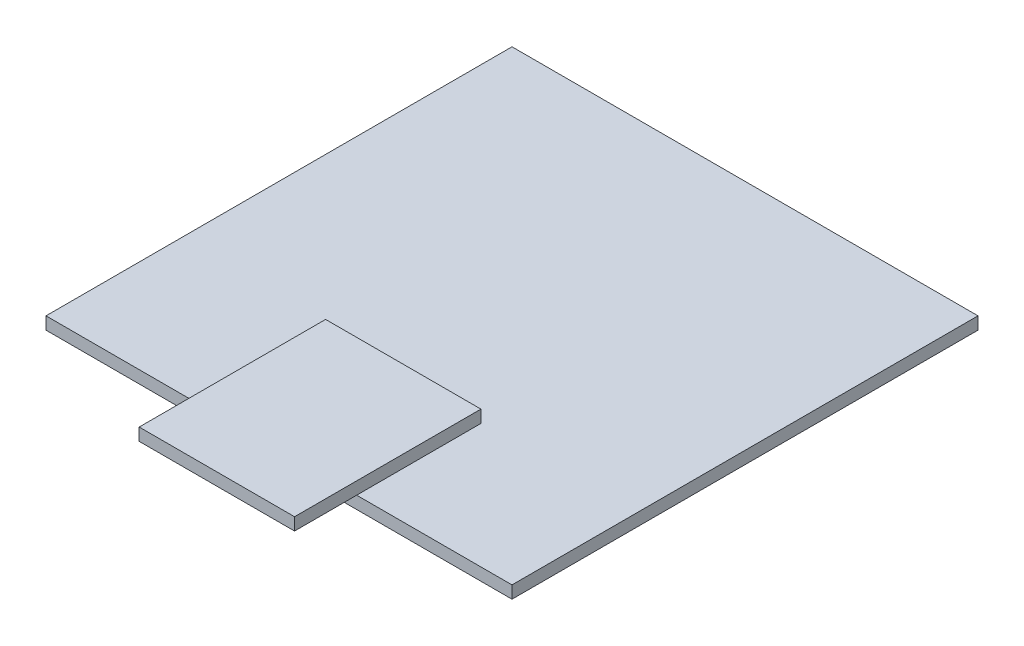
ISO-10303-21;
HEADER;
FILE_DESCRIPTION(('STEP AP214'),'2;1');
FILE_NAME('part.step','',(''),(''),'','','');
FILE_SCHEMA(('AUTOMOTIVE_DESIGN { 1 0 10303 214 1 1 1 1 }'));
ENDSEC;
DATA;
#1=APPLICATION_CONTEXT('core data for automotive mechanical design processes');
#2=APPLICATION_PROTOCOL_DEFINITION('international standard','automotive_design',2000,#1);
#3=PRODUCT_CONTEXT('',#1,'mechanical');
#4=PRODUCT('Part','Part','',(#3));
#5=PRODUCT_RELATED_PRODUCT_CATEGORY('part','',(#4));
#6=PRODUCT_DEFINITION_FORMATION('','',#4);
#7=PRODUCT_DEFINITION_CONTEXT('part definition',#1,'design');
#8=PRODUCT_DEFINITION('design','',#6,#7);
#9=PRODUCT_DEFINITION_SHAPE('','',#8);
#10=(LENGTH_UNIT() NAMED_UNIT(*) SI_UNIT(.MILLI.,.METRE.));
#11=(NAMED_UNIT(*) PLANE_ANGLE_UNIT() SI_UNIT($,.RADIAN.));
#12=(NAMED_UNIT(*) SI_UNIT($,.STERADIAN.) SOLID_ANGLE_UNIT());
#13=UNCERTAINTY_MEASURE_WITH_UNIT(LENGTH_MEASURE(1.E-05),#10,'distance_accuracy_value','');
#14=(GEOMETRIC_REPRESENTATION_CONTEXT(3) GLOBAL_UNCERTAINTY_ASSIGNED_CONTEXT((#13)) GLOBAL_UNIT_ASSIGNED_CONTEXT((#10,
#11,#12)) REPRESENTATION_CONTEXT('',''));
#15=CARTESIAN_POINT('',(0.,0.,0.));
#16=DIRECTION('',(0.,0.,1.));
#17=DIRECTION('',(1.,0.,0.));
#18=AXIS2_PLACEMENT_3D('',#15,#16,#17);
#19=CARTESIAN_POINT('',(0.,4.,0.));
#20=DIRECTION('',(0.,-1.,0.));
#21=DIRECTION('',(0.,0.,-1.));
#22=AXIS2_PLACEMENT_3D('',#19,#20,#21);
#23=PLANE('',#22);
#24=DIRECTION('',(0.,0.,1.));
#25=VECTOR('',#24,1.);
#26=CARTESIAN_POINT('',(50.,4.,-40.));
#27=LINE('',#26,#25);
#28=CARTESIAN_POINT('',(50.,4.,-40.));
#29=VERTEX_POINT('',#28);
#30=CARTESIAN_POINT('',(50.,4.,0.));
#31=VERTEX_POINT('',#30);
#32=EDGE_CURVE('E53',#29,#31,#27,.T.);
#33=ORIENTED_EDGE('',*,*,#32,.F.);
#34=DIRECTION('',(-1.,0.,0.));
#35=VECTOR('',#34,1.);
#36=CARTESIAN_POINT('',(50.,4.,-40.));
#37=LINE('',#36,#35);
#38=CARTESIAN_POINT('',(100.,4.,-40.));
#39=VERTEX_POINT('',#38);
#40=EDGE_CURVE('E126',#39,#29,#37,.T.);
#41=ORIENTED_EDGE('',*,*,#40,.F.);
#42=DIRECTION('',(0.,0.,-1.));
#43=VECTOR('',#42,1.);
#44=CARTESIAN_POINT('',(100.,4.,-40.));
#45=LINE('',#44,#43);
#46=CARTESIAN_POINT('',(100.,4.,0.));
#47=VERTEX_POINT('',#46);
#48=EDGE_CURVE('E11',#47,#39,#45,.T.);
#49=ORIENTED_EDGE('',*,*,#48,.F.);
#50=DIRECTION('',(1.,0.,0.));
#51=VECTOR('',#50,1.);
#52=CARTESIAN_POINT('',(0.,4.,0.));
#53=LINE('',#52,#51);
#54=CARTESIAN_POINT('',(150.,4.,0.));
#55=VERTEX_POINT('',#54);
#56=EDGE_CURVE('E144',#47,#55,#53,.T.);
#57=ORIENTED_EDGE('',*,*,#56,.T.);
#58=DIRECTION('',(0.,0.,-1.));
#59=VECTOR('',#58,1.);
#60=CARTESIAN_POINT('',(150.,4.,0.));
#61=LINE('',#60,#59);
#62=CARTESIAN_POINT('',(150.,4.,-150.));
#63=VERTEX_POINT('',#62);
#64=EDGE_CURVE('E148',#55,#63,#61,.T.);
#65=ORIENTED_EDGE('',*,*,#64,.T.);
#66=DIRECTION('',(-1.,0.,0.));
#67=VECTOR('',#66,1.);
#68=CARTESIAN_POINT('',(0.,4.,-150.));
#69=LINE('',#68,#67);
#70=CARTESIAN_POINT('',(0.,4.,-150.));
#71=VERTEX_POINT('',#70);
#72=EDGE_CURVE('E151',#63,#71,#69,.T.);
#73=ORIENTED_EDGE('',*,*,#72,.T.);
#74=DIRECTION('',(0.,0.,1.));
#75=VECTOR('',#74,1.);
#76=CARTESIAN_POINT('',(0.,4.,0.));
#77=LINE('',#76,#75);
#78=CARTESIAN_POINT('',(0.,4.,0.));
#79=VERTEX_POINT('',#78);
#80=EDGE_CURVE('E141',#71,#79,#77,.T.);
#81=ORIENTED_EDGE('',*,*,#80,.T.);
#82=EDGE_CURVE('E146',#79,#31,#53,.T.);
#83=ORIENTED_EDGE('',*,*,#82,.T.);
#84=EDGE_LOOP('',(#33,#41,#49,#57,#65,#73,#81,#83));
#85=FACE_BOUND('',#84,.T.);
#86=ADVANCED_FACE('F36',(#85),#23,.F.);
#87=CARTESIAN_POINT('',(0.,4.,0.));
#88=DIRECTION('',(1.,0.,0.));
#89=DIRECTION('',(0.,0.,-1.));
#90=AXIS2_PLACEMENT_3D('',#87,#88,#89);
#91=PLANE('',#90);
#92=DIRECTION('',(0.,0.,1.));
#93=VECTOR('',#92,1.);
#94=CARTESIAN_POINT('',(0.,0.,0.));
#95=LINE('',#94,#93);
#96=CARTESIAN_POINT('',(0.,0.,-150.));
#97=VERTEX_POINT('',#96);
#98=CARTESIAN_POINT('',(0.,0.,0.));
#99=VERTEX_POINT('',#98);
#100=EDGE_CURVE('E132',#97,#99,#95,.T.);
#101=ORIENTED_EDGE('',*,*,#100,.T.);
#102=DIRECTION('',(0.,-1.,0.));
#103=VECTOR('',#102,1.);
#104=CARTESIAN_POINT('',(0.,4.,0.));
#105=LINE('',#104,#103);
#106=EDGE_CURVE('E40',#79,#99,#105,.T.);
#107=ORIENTED_EDGE('',*,*,#106,.F.);
#108=ORIENTED_EDGE('',*,*,#80,.F.);
#109=DIRECTION('',(0.,-1.,0.));
#110=VECTOR('',#109,1.);
#111=CARTESIAN_POINT('',(0.,4.,-150.));
#112=LINE('',#111,#110);
#113=EDGE_CURVE('E152',#71,#97,#112,.T.);
#114=ORIENTED_EDGE('',*,*,#113,.T.);
#115=EDGE_LOOP('',(#101,#107,#108,#114));
#116=FACE_BOUND('',#115,.T.);
#117=ADVANCED_FACE('F38',(#116),#91,.F.);
#118=CARTESIAN_POINT('',(0.,4.,0.));
#119=DIRECTION('',(0.,0.,-1.));
#120=DIRECTION('',(-1.,0.,0.));
#121=AXIS2_PLACEMENT_3D('',#118,#119,#120);
#122=PLANE('',#121);
#123=DIRECTION('',(1.,0.,0.));
#124=VECTOR('',#123,1.);
#125=CARTESIAN_POINT('',(0.,0.,0.));
#126=LINE('',#125,#124);
#127=CARTESIAN_POINT('',(150.,0.,0.));
#128=VERTEX_POINT('',#127);
#129=EDGE_CURVE('E135',#99,#128,#126,.T.);
#130=ORIENTED_EDGE('',*,*,#129,.T.);
#131=DIRECTION('',(0.,-1.,0.));
#132=VECTOR('',#131,1.);
#133=CARTESIAN_POINT('',(150.,4.,0.));
#134=LINE('',#133,#132);
#135=EDGE_CURVE('E162',#55,#128,#134,.T.);
#136=ORIENTED_EDGE('',*,*,#135,.F.);
#137=ORIENTED_EDGE('',*,*,#56,.F.);
#138=EDGE_CURVE('E149',#31,#47,#53,.T.);
#139=ORIENTED_EDGE('',*,*,#138,.F.);
#140=ORIENTED_EDGE('',*,*,#82,.F.);
#141=ORIENTED_EDGE('',*,*,#106,.T.);
#142=EDGE_LOOP('',(#130,#136,#137,#139,#140,#141));
#143=FACE_BOUND('',#142,.T.);
#144=ADVANCED_FACE('F171',(#143),#122,.F.);
#145=CARTESIAN_POINT('',(150.,4.,0.));
#146=DIRECTION('',(-1.,0.,0.));
#147=DIRECTION('',(0.,0.,1.));
#148=AXIS2_PLACEMENT_3D('',#145,#146,#147);
#149=PLANE('',#148);
#150=DIRECTION('',(0.,0.,-1.));
#151=VECTOR('',#150,1.);
#152=CARTESIAN_POINT('',(150.,0.,0.));
#153=LINE('',#152,#151);
#154=CARTESIAN_POINT('',(150.,0.,-150.));
#155=VERTEX_POINT('',#154);
#156=EDGE_CURVE('E155',#128,#155,#153,.T.);
#157=ORIENTED_EDGE('',*,*,#156,.T.);
#158=DIRECTION('',(0.,-1.,0.));
#159=VECTOR('',#158,1.);
#160=CARTESIAN_POINT('',(150.,4.,-150.));
#161=LINE('',#160,#159);
#162=EDGE_CURVE('E160',#63,#155,#161,.T.);
#163=ORIENTED_EDGE('',*,*,#162,.F.);
#164=ORIENTED_EDGE('',*,*,#64,.F.);
#165=ORIENTED_EDGE('',*,*,#135,.T.);
#166=EDGE_LOOP('',(#157,#163,#164,#165));
#167=FACE_BOUND('',#166,.T.);
#168=ADVANCED_FACE('F180',(#167),#149,.F.);
#169=CARTESIAN_POINT('',(0.,4.,-150.));
#170=DIRECTION('',(0.,0.,1.));
#171=DIRECTION('',(1.,0.,0.));
#172=AXIS2_PLACEMENT_3D('',#169,#170,#171);
#173=PLANE('',#172);
#174=DIRECTION('',(-1.,0.,0.));
#175=VECTOR('',#174,1.);
#176=CARTESIAN_POINT('',(0.,0.,-150.));
#177=LINE('',#176,#175);
#178=EDGE_CURVE('E145',#155,#97,#177,.T.);
#179=ORIENTED_EDGE('',*,*,#178,.T.);
#180=ORIENTED_EDGE('',*,*,#113,.F.);
#181=ORIENTED_EDGE('',*,*,#72,.F.);
#182=ORIENTED_EDGE('',*,*,#162,.T.);
#183=EDGE_LOOP('',(#179,#180,#181,#182));
#184=FACE_BOUND('',#183,.T.);
#185=ADVANCED_FACE('F183',(#184),#173,.F.);
#186=CARTESIAN_POINT('',(0.,0.,0.));
#187=DIRECTION('',(0.,-1.,0.));
#188=DIRECTION('',(0.,0.,-1.));
#189=AXIS2_PLACEMENT_3D('',#186,#187,#188);
#190=PLANE('',#189);
#191=ORIENTED_EDGE('',*,*,#100,.F.);
#192=ORIENTED_EDGE('',*,*,#178,.F.);
#193=ORIENTED_EDGE('',*,*,#156,.F.);
#194=ORIENTED_EDGE('',*,*,#129,.F.);
#195=EDGE_LOOP('',(#191,#192,#193,#194));
#196=FACE_BOUND('',#195,.T.);
#197=ADVANCED_FACE('F178',(#196),#190,.T.);
#198=CARTESIAN_POINT('',(0.,4.,0.));
#199=DIRECTION('',(0.,1.,0.));
#200=DIRECTION('',(0.,0.,1.));
#201=AXIS2_PLACEMENT_3D('',#198,#199,#200);
#202=PLANE('',#201);
#203=CARTESIAN_POINT('',(50.,4.,20.));
#204=VERTEX_POINT('',#203);
#205=EDGE_CURVE('E130',#31,#204,#27,.T.);
#206=ORIENTED_EDGE('',*,*,#205,.F.);
#207=ORIENTED_EDGE('',*,*,#138,.T.);
#208=CARTESIAN_POINT('',(100.,4.,20.));
#209=VERTEX_POINT('',#208);
#210=EDGE_CURVE('E46',#209,#47,#45,.T.);
#211=ORIENTED_EDGE('',*,*,#210,.F.);
#212=DIRECTION('',(1.,0.,0.));
#213=VECTOR('',#212,1.);
#214=CARTESIAN_POINT('',(50.,4.,20.));
#215=LINE('',#214,#213);
#216=EDGE_CURVE('E193',#204,#209,#215,.T.);
#217=ORIENTED_EDGE('',*,*,#216,.F.);
#218=EDGE_LOOP('',(#206,#207,#211,#217));
#219=FACE_BOUND('',#218,.T.);
#220=ADVANCED_FACE('F188',(#219),#202,.F.);
#221=CARTESIAN_POINT('',(50.,8.,-40.));
#222=DIRECTION('',(1.,0.,0.));
#223=DIRECTION('',(0.,0.,-1.));
#224=AXIS2_PLACEMENT_3D('',#221,#222,#223);
#225=PLANE('',#224);
#226=ORIENTED_EDGE('',*,*,#32,.T.);
#227=ORIENTED_EDGE('',*,*,#205,.T.);
#228=DIRECTION('',(0.,-1.,0.));
#229=VECTOR('',#228,1.);
#230=CARTESIAN_POINT('',(50.,8.,20.));
#231=LINE('',#230,#229);
#232=CARTESIAN_POINT('',(50.,8.,20.));
#233=VERTEX_POINT('',#232);
#234=EDGE_CURVE('E111',#233,#204,#231,.T.);
#235=ORIENTED_EDGE('',*,*,#234,.F.);
#236=DIRECTION('',(0.,0.,1.));
#237=VECTOR('',#236,1.);
#238=CARTESIAN_POINT('',(50.,8.,-40.));
#239=LINE('',#238,#237);
#240=CARTESIAN_POINT('',(50.,8.,-40.));
#241=VERTEX_POINT('',#240);
#242=EDGE_CURVE('E117',#241,#233,#239,.T.);
#243=ORIENTED_EDGE('',*,*,#242,.F.);
#244=DIRECTION('',(0.,-1.,0.));
#245=VECTOR('',#244,1.);
#246=CARTESIAN_POINT('',(50.,8.,-40.));
#247=LINE('',#246,#245);
#248=EDGE_CURVE('E198',#241,#29,#247,.T.);
#249=ORIENTED_EDGE('',*,*,#248,.T.);
#250=EDGE_LOOP('',(#226,#227,#235,#243,#249));
#251=FACE_BOUND('',#250,.T.);
#252=ADVANCED_FACE('F128',(#251),#225,.F.);
#253=CARTESIAN_POINT('',(50.,8.,20.));
#254=DIRECTION('',(0.,0.,-1.));
#255=DIRECTION('',(-1.,0.,0.));
#256=AXIS2_PLACEMENT_3D('',#253,#254,#255);
#257=PLANE('',#256);
#258=ORIENTED_EDGE('',*,*,#216,.T.);
#259=DIRECTION('',(0.,-1.,0.));
#260=VECTOR('',#259,1.);
#261=CARTESIAN_POINT('',(100.,8.,20.));
#262=LINE('',#261,#260);
#263=CARTESIAN_POINT('',(100.,8.,20.));
#264=VERTEX_POINT('',#263);
#265=EDGE_CURVE('E113',#264,#209,#262,.T.);
#266=ORIENTED_EDGE('',*,*,#265,.F.);
#267=DIRECTION('',(1.,0.,0.));
#268=VECTOR('',#267,1.);
#269=CARTESIAN_POINT('',(50.,8.,20.));
#270=LINE('',#269,#268);
#271=EDGE_CURVE('E107',#233,#264,#270,.T.);
#272=ORIENTED_EDGE('',*,*,#271,.F.);
#273=ORIENTED_EDGE('',*,*,#234,.T.);
#274=EDGE_LOOP('',(#258,#266,#272,#273));
#275=FACE_BOUND('',#274,.T.);
#276=ADVANCED_FACE('F109',(#275),#257,.F.);
#277=CARTESIAN_POINT('',(100.,8.,-40.));
#278=DIRECTION('',(-1.,0.,0.));
#279=DIRECTION('',(0.,0.,1.));
#280=AXIS2_PLACEMENT_3D('',#277,#278,#279);
#281=PLANE('',#280);
#282=ORIENTED_EDGE('',*,*,#210,.T.);
#283=ORIENTED_EDGE('',*,*,#48,.T.);
#284=DIRECTION('',(0.,-1.,0.));
#285=VECTOR('',#284,1.);
#286=CARTESIAN_POINT('',(100.,8.,-40.));
#287=LINE('',#286,#285);
#288=CARTESIAN_POINT('',(100.,8.,-40.));
#289=VERTEX_POINT('',#288);
#290=EDGE_CURVE('E137',#289,#39,#287,.T.);
#291=ORIENTED_EDGE('',*,*,#290,.F.);
#292=DIRECTION('',(0.,0.,-1.));
#293=VECTOR('',#292,1.);
#294=CARTESIAN_POINT('',(100.,8.,-40.));
#295=LINE('',#294,#293);
#296=EDGE_CURVE('E116',#264,#289,#295,.T.);
#297=ORIENTED_EDGE('',*,*,#296,.F.);
#298=ORIENTED_EDGE('',*,*,#265,.T.);
#299=EDGE_LOOP('',(#282,#283,#291,#297,#298));
#300=FACE_BOUND('',#299,.T.);
#301=ADVANCED_FACE('F190',(#300),#281,.F.);
#302=CARTESIAN_POINT('',(50.,8.,-40.));
#303=DIRECTION('',(0.,0.,1.));
#304=DIRECTION('',(1.,0.,0.));
#305=AXIS2_PLACEMENT_3D('',#302,#303,#304);
#306=PLANE('',#305);
#307=ORIENTED_EDGE('',*,*,#40,.T.);
#308=ORIENTED_EDGE('',*,*,#248,.F.);
#309=DIRECTION('',(-1.,0.,0.));
#310=VECTOR('',#309,1.);
#311=CARTESIAN_POINT('',(50.,8.,-40.));
#312=LINE('',#311,#310);
#313=EDGE_CURVE('E122',#289,#241,#312,.T.);
#314=ORIENTED_EDGE('',*,*,#313,.F.);
#315=ORIENTED_EDGE('',*,*,#290,.T.);
#316=EDGE_LOOP('',(#307,#308,#314,#315));
#317=FACE_BOUND('',#316,.T.);
#318=ADVANCED_FACE('F200',(#317),#306,.F.);
#319=CARTESIAN_POINT('',(0.,8.,0.));
#320=DIRECTION('',(0.,1.,0.));
#321=DIRECTION('',(0.,0.,1.));
#322=AXIS2_PLACEMENT_3D('',#319,#320,#321);
#323=PLANE('',#322);
#324=ORIENTED_EDGE('',*,*,#242,.T.);
#325=ORIENTED_EDGE('',*,*,#271,.T.);
#326=ORIENTED_EDGE('',*,*,#296,.T.);
#327=ORIENTED_EDGE('',*,*,#313,.T.);
#328=EDGE_LOOP('',(#324,#325,#326,#327));
#329=FACE_BOUND('',#328,.T.);
#330=ADVANCED_FACE('F120',(#329),#323,.T.);
#331=CLOSED_SHELL('',(#86,#117,#144,#168,#185,#197,#220,#252,#276,#301,#318,#330));
#332=MANIFOLD_SOLID_BREP('B2',#331);
#333=ADVANCED_BREP_SHAPE_REPRESENTATION('',(#18,#332),#14);
#334=SHAPE_DEFINITION_REPRESENTATION(#9,#333);
ENDSEC;
END-ISO-10303-21;
